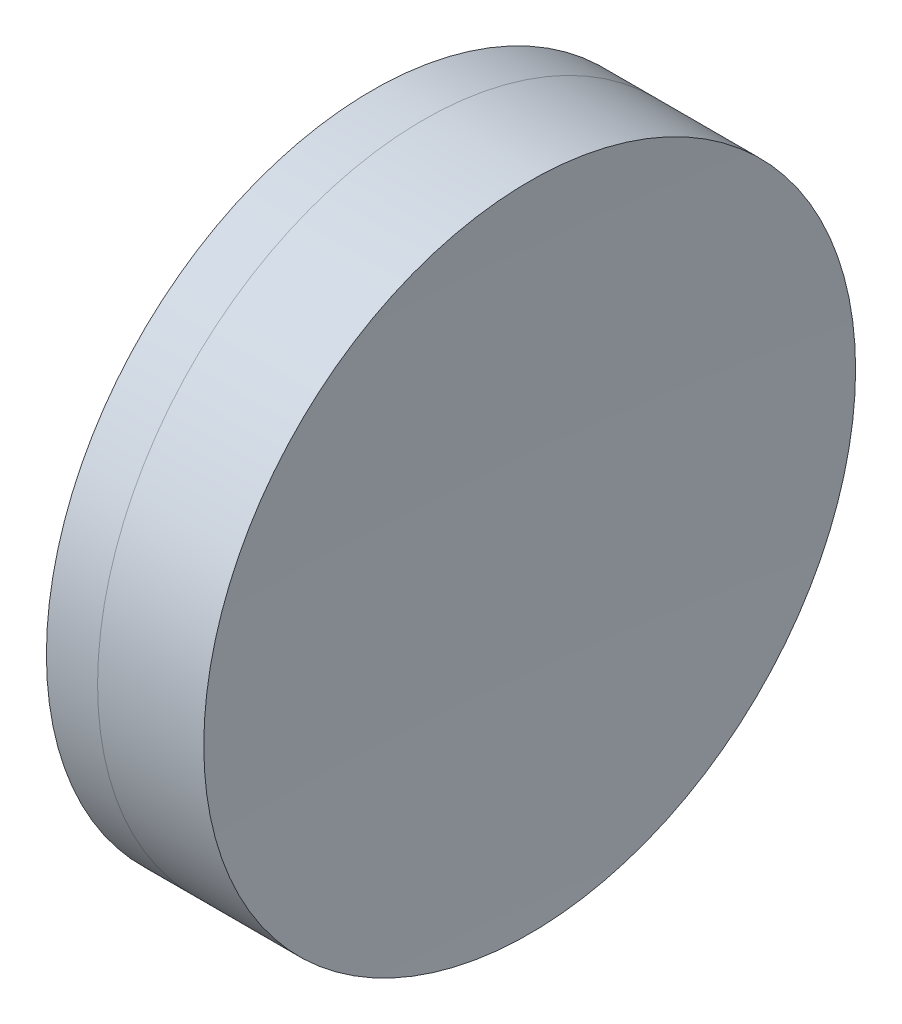
ISO-10303-21;
HEADER;
FILE_DESCRIPTION(('STEP AP214'),'2;1');
FILE_NAME('part.step','',(''),(''),'','','');
FILE_SCHEMA(('AUTOMOTIVE_DESIGN { 1 0 10303 214 1 1 1 1 }'));
ENDSEC;
DATA;
#1=APPLICATION_CONTEXT('core data for automotive mechanical design processes');
#2=APPLICATION_PROTOCOL_DEFINITION('international standard','automotive_design',2000,#1);
#3=PRODUCT_CONTEXT('',#1,'mechanical');
#4=PRODUCT('Part','Part','',(#3));
#5=PRODUCT_RELATED_PRODUCT_CATEGORY('part','',(#4));
#6=PRODUCT_DEFINITION_FORMATION('','',#4);
#7=PRODUCT_DEFINITION_CONTEXT('part definition',#1,'design');
#8=PRODUCT_DEFINITION('design','',#6,#7);
#9=PRODUCT_DEFINITION_SHAPE('','',#8);
#10=(LENGTH_UNIT() NAMED_UNIT(*) SI_UNIT(.MILLI.,.METRE.));
#11=(NAMED_UNIT(*) PLANE_ANGLE_UNIT() SI_UNIT($,.RADIAN.));
#12=(NAMED_UNIT(*) SI_UNIT($,.STERADIAN.) SOLID_ANGLE_UNIT());
#13=UNCERTAINTY_MEASURE_WITH_UNIT(LENGTH_MEASURE(1.E-05),#10,'distance_accuracy_value','');
#14=(GEOMETRIC_REPRESENTATION_CONTEXT(3) GLOBAL_UNCERTAINTY_ASSIGNED_CONTEXT((#13)) GLOBAL_UNIT_ASSIGNED_CONTEXT((#10,
#11,#12)) REPRESENTATION_CONTEXT('',''));
#15=CARTESIAN_POINT('',(0.,0.,0.));
#16=DIRECTION('',(0.,0.,1.));
#17=DIRECTION('',(1.,0.,0.));
#18=AXIS2_PLACEMENT_3D('',#15,#16,#17);
#19=CARTESIAN_POINT('',(2.72415925380743,0.,0.));
#20=DIRECTION('',(-1.,0.,0.));
#21=DIRECTION('',(0.,0.,1.));
#22=AXIS2_PLACEMENT_3D('',#19,#20,#21);
#23=SPHERICAL_SURFACE('',#22,95.9400000000001);
#24=CARTESIAN_POINT('',(97.8198668330669,0.,0.));
#25=DIRECTION('',(-1.,0.,0.));
#26=DIRECTION('',(0.,0.,1.));
#27=AXIS2_PLACEMENT_3D('',#24,#25,#26);
#28=CIRCLE('',#27,12.7);
#29=CARTESIAN_POINT('',(97.8198668330669,0.,12.7));
#30=VERTEX_POINT('',#29);
#31=EDGE_CURVE('E51',#30,#30,#28,.T.);
#32=ORIENTED_EDGE('',*,*,#31,.T.);
#33=EDGE_LOOP('',(#32));
#34=FACE_BOUND('',#33,.T.);
#35=ADVANCED_FACE('F45',(#34),#23,.F.);
#36=CARTESIAN_POINT('',(375.974159253807,0.,0.));
#37=DIRECTION('',(-1.,0.,0.));
#38=DIRECTION('',(0.,0.,-1.));
#39=AXIS2_PLACEMENT_3D('',#36,#37,#38);
#40=SPHERICAL_SURFACE('',#39,274.31);
#41=CARTESIAN_POINT('',(101.958309164803,0.,0.));
#42=DIRECTION('',(-1.,0.,0.));
#43=DIRECTION('',(0.,0.,1.));
#44=AXIS2_PLACEMENT_3D('',#41,#42,#43);
#45=CIRCLE('',#44,12.7);
#46=CARTESIAN_POINT('',(101.958309164803,0.,12.7));
#47=VERTEX_POINT('',#46);
#48=EDGE_CURVE('E11',#47,#47,#45,.T.);
#49=ORIENTED_EDGE('',*,*,#48,.F.);
#50=EDGE_LOOP('',(#49));
#51=FACE_BOUND('',#50,.T.);
#52=ADVANCED_FACE('F60',(#51),#40,.F.);
#53=CARTESIAN_POINT('',(-0.551919992657797,0.,0.));
#54=DIRECTION('',(-1.,0.,0.));
#55=DIRECTION('',(0.,0.,1.));
#56=AXIS2_PLACEMENT_3D('',#53,#54,#55);
#57=CYLINDRICAL_SURFACE('',#56,12.7);
#58=ORIENTED_EDGE('',*,*,#48,.T.);
#59=EDGE_LOOP('',(#58));
#60=FACE_BOUND('',#59,.T.);
#61=ORIENTED_EDGE('',*,*,#31,.F.);
#62=EDGE_LOOP('',(#61));
#63=FACE_BOUND('',#62,.T.);
#64=ADVANCED_FACE('F58',(#60,#63),#57,.T.);
#65=CLOSED_SHELL('',(#35,#52,#64));
#66=MANIFOLD_SOLID_BREP('B2',#65);
#67=CARTESIAN_POINT('',(164.664159253807,0.,0.));
#68=DIRECTION('',(-1.,0.,0.));
#69=DIRECTION('',(0.,0.,-1.));
#70=AXIS2_PLACEMENT_3D('',#67,#68,#69);
#71=SPHERICAL_SURFACE('',#70,70.);
#72=CARTESIAN_POINT('',(95.8258704894867,0.,0.));
#73=DIRECTION('',(-1.,0.,0.));
#74=DIRECTION('',(0.,0.,1.));
#75=AXIS2_PLACEMENT_3D('',#72,#73,#74);
#76=CIRCLE('',#75,12.7);
#77=CARTESIAN_POINT('',(95.8258704894867,0.,12.7));
#78=VERTEX_POINT('',#77);
#79=EDGE_CURVE('E44',#78,#78,#76,.T.);
#80=ORIENTED_EDGE('',*,*,#79,.T.);
#81=EDGE_LOOP('',(#80));
#82=FACE_BOUND('',#81,.T.);
#83=ADVANCED_FACE('F86',(#82),#71,.T.);
#84=CARTESIAN_POINT('',(-0.816062176165804,0.,0.));
#85=DIRECTION('',(-1.,0.,0.));
#86=DIRECTION('',(0.,0.,1.));
#87=AXIS2_PLACEMENT_3D('',#84,#85,#86);
#88=CYLINDRICAL_SURFACE('',#87,12.7);
#89=CARTESIAN_POINT('',(97.8198668330669,0.,0.));
#90=DIRECTION('',(-1.,0.,0.));
#91=DIRECTION('',(0.,0.,1.));
#92=AXIS2_PLACEMENT_3D('',#89,#90,#91);
#93=CIRCLE('',#92,12.7);
#94=CARTESIAN_POINT('',(97.8198668330669,0.,12.7));
#95=VERTEX_POINT('',#94);
#96=EDGE_CURVE('E92',#95,#95,#93,.T.);
#97=ORIENTED_EDGE('',*,*,#96,.T.);
#98=EDGE_LOOP('',(#97));
#99=FACE_BOUND('',#98,.T.);
#100=ORIENTED_EDGE('',*,*,#79,.F.);
#101=EDGE_LOOP('',(#100));
#102=FACE_BOUND('',#101,.T.);
#103=ADVANCED_FACE('F98',(#99,#102),#88,.T.);
#104=CARTESIAN_POINT('',(2.72415925380743,0.,0.));
#105=DIRECTION('',(-1.,0.,0.));
#106=DIRECTION('',(0.,0.,1.));
#107=AXIS2_PLACEMENT_3D('',#104,#105,#106);
#108=SPHERICAL_SURFACE('',#107,95.9400000000001);
#109=ORIENTED_EDGE('',*,*,#96,.F.);
#110=EDGE_LOOP('',(#109));
#111=FACE_BOUND('',#110,.T.);
#112=ADVANCED_FACE('F101',(#111),#108,.T.);
#113=CLOSED_SHELL('',(#83,#103,#112));
#114=MANIFOLD_SOLID_BREP('B6',#113);
#115=ADVANCED_BREP_SHAPE_REPRESENTATION('',(#18,#66,#114),#14);
#116=SHAPE_DEFINITION_REPRESENTATION(#9,#115);
ENDSEC;
END-ISO-10303-21;
